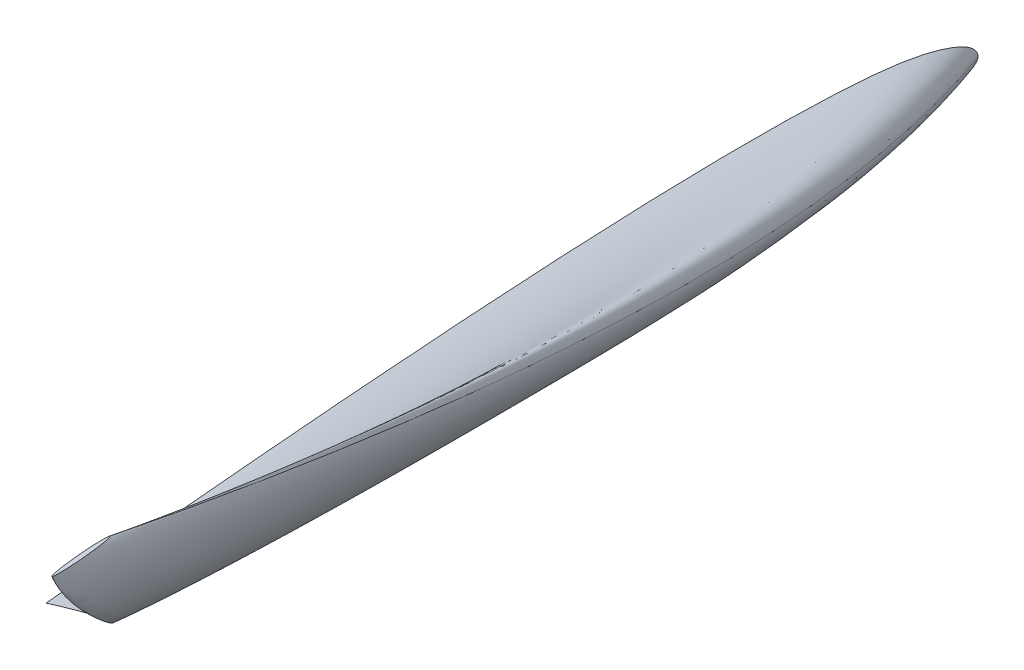
ISO-10303-21;
HEADER;
FILE_DESCRIPTION(('STEP AP214'),'2;1');
FILE_NAME('part.step','',(''),(''),'','','');
FILE_SCHEMA(('AUTOMOTIVE_DESIGN { 1 0 10303 214 1 1 1 1 }'));
ENDSEC;
DATA;
#1=APPLICATION_CONTEXT('core data for automotive mechanical design processes');
#2=APPLICATION_PROTOCOL_DEFINITION('international standard','automotive_design',2000,#1);
#3=PRODUCT_CONTEXT('',#1,'mechanical');
#4=PRODUCT('Part','Part','',(#3));
#5=PRODUCT_RELATED_PRODUCT_CATEGORY('part','',(#4));
#6=PRODUCT_DEFINITION_FORMATION('','',#4);
#7=PRODUCT_DEFINITION_CONTEXT('part definition',#1,'design');
#8=PRODUCT_DEFINITION('design','',#6,#7);
#9=PRODUCT_DEFINITION_SHAPE('','',#8);
#10=(LENGTH_UNIT() NAMED_UNIT(*) SI_UNIT(.MILLI.,.METRE.));
#11=(NAMED_UNIT(*) PLANE_ANGLE_UNIT() SI_UNIT($,.RADIAN.));
#12=(NAMED_UNIT(*) SI_UNIT($,.STERADIAN.) SOLID_ANGLE_UNIT());
#13=UNCERTAINTY_MEASURE_WITH_UNIT(LENGTH_MEASURE(1.E-05),#10,'distance_accuracy_value','');
#14=(GEOMETRIC_REPRESENTATION_CONTEXT(3) GLOBAL_UNCERTAINTY_ASSIGNED_CONTEXT((#13)) GLOBAL_UNIT_ASSIGNED_CONTEXT((#10,
#11,#12)) REPRESENTATION_CONTEXT('',''));
#15=CARTESIAN_POINT('',(0.,0.,0.));
#16=DIRECTION('',(0.,0.,1.));
#17=DIRECTION('',(1.,0.,0.));
#18=AXIS2_PLACEMENT_3D('',#15,#16,#17);
#19=CARTESIAN_POINT('',(3360.,218.360771483085,401.404372852106));
#20=DIRECTION('',(1.,0.,0.));
#21=DIRECTION('',(0.,0.,-1.));
#22=AXIS2_PLACEMENT_3D('',#19,#20,#21);
#23=PLANE('',#22);
#24=CARTESIAN_POINT('',(3360.,229.119465308292,843.640653398132));
#25=CARTESIAN_POINT('',(3360.,215.464436299408,713.782358784149));
#26=CARTESIAN_POINT('',(3360.,216.556538162591,406.942823213811));
#27=CARTESIAN_POINT('',(3360.,221.464120714238,350.841141044395));
#28=CARTESIAN_POINT('',(3360.,225.556401664433,317.114757853201));
#29=CARTESIAN_POINT('',(3360.,233.068162146631,316.471394972551));
#30=B_SPLINE_CURVE_WITH_KNOTS('',3,(#24,#25,#26,#27,#28,#29),.UNSPECIFIED.,.F.,.F.,(4,1,1,4),
(0.,0.526727838627796,0.626727838627796,1.),.UNSPECIFIED.);
#31=CARTESIAN_POINT('',(3360.,229.119465308292,843.640653398131));
#32=VERTEX_POINT('',#31);
#33=CARTESIAN_POINT('',(3360.,233.06816214663,316.471394972551));
#34=VERTEX_POINT('',#33);
#35=EDGE_CURVE('E50',#32,#34,#30,.T.);
#36=ORIENTED_EDGE('',*,*,#35,.F.);
#37=CARTESIAN_POINT('',(3360.,233.06816214663,316.471394972551));
#38=CARTESIAN_POINT('',(3360.,239.351434862468,316.465549593679));
#39=CARTESIAN_POINT('',(3360.,249.881065643531,339.710619295084));
#40=CARTESIAN_POINT('',(3360.,267.643801952184,486.64347624095));
#41=CARTESIAN_POINT('',(3360.,233.367819513329,792.168022962579));
#42=CARTESIAN_POINT('',(3360.,229.119465308292,843.640653398131));
#43=B_SPLINE_CURVE_WITH_KNOTS('',3,(#37,#38,#39,#40,#41,#42),.UNSPECIFIED.,.F.,.F.,(4,1,1,4),
(0.,0.0940570235538322,0.194057023553832,1.),.UNSPECIFIED.);
#44=EDGE_CURVE('E11',#34,#32,#43,.T.);
#45=ORIENTED_EDGE('',*,*,#44,.F.);
#46=EDGE_LOOP('',(#36,#45));
#47=FACE_BOUND('',#46,.T.);
#48=ADVANCED_FACE('F40',(#47),#23,.F.);
#49=CARTESIAN_POINT('',(3477.86129527714,360.,941.693828195113));
#50=DIRECTION('',(0.,1.,0.));
#51=DIRECTION('',(0.,0.,1.));
#52=AXIS2_PLACEMENT_3D('',#49,#50,#51);
#53=PLANE('',#52);
#54=CARTESIAN_POINT('',(3477.86129527714,360.,941.693828195113));
#55=DIRECTION('',(0.,1.,0.));
#56=DIRECTION('',(-0.0905357460425174,0.,-0.995893206467704));
#57=AXIS2_PLACEMENT_3D('',#54,#55,#56);
#58=ELLIPSE('',#57,18.1729529725233,1.3406276783011);
#59=CARTESIAN_POINT('',(3476.22498409216,360.,923.595100798655));
#60=VERTEX_POINT('',#59);
#61=CARTESIAN_POINT('',(3479.5065971323,360.,959.792148601906));
#62=VERTEX_POINT('',#61);
#63=EDGE_CURVE('E78',#60,#62,#58,.T.);
#64=ORIENTED_EDGE('',*,*,#63,.T.);
#65=EDGE_CURVE('E74',#62,#60,#58,.T.);
#66=ORIENTED_EDGE('',*,*,#65,.T.);
#67=EDGE_LOOP('',(#64,#66));
#68=FACE_BOUND('',#67,.T.);
#69=ADVANCED_FACE('F88',(#68),#53,.T.);
#70=CARTESIAN_POINT('',(3476.22498409216,360.,923.595100798655));
#71=CARTESIAN_POINT('',(3477.50289840618,325.745592423653,745.570228461219));
#72=CARTESIAN_POINT('',(3456.56167243609,277.724137591087,503.109039222426));
#73=CARTESIAN_POINT('',(3360.,233.068162146631,316.471394972551));
#74=CARTESIAN_POINT('',(3476.24886622401,360.,923.595100798655));
#75=CARTESIAN_POINT('',(3477.51881982741,325.630831702288,745.58005742055));
#76=CARTESIAN_POINT('',(3456.5696331467,277.494616148357,503.128697141088));
#77=CARTESIAN_POINT('',(3360.,232.723879982536,316.500881850544));
#78=CARTESIAN_POINT('',(3476.28245943853,360.,923.607471111499));
#79=CARTESIAN_POINT('',(3477.54121530375,325.461370510209,745.631235726874));
#80=CARTESIAN_POINT('',(3456.58083088488,277.155693764199,503.218683440893));
#81=CARTESIAN_POINT('',(3360.,232.215496406299,316.629676143829));
#82=CARTESIAN_POINT('',(3476.32172938726,360.,923.637056443417));
#83=CARTESIAN_POINT('',(3477.56739526958,325.255026312158,745.754373604101));
#84=CARTESIAN_POINT('',(3456.59392086779,276.743005368097,503.435373863428));
#85=CARTESIAN_POINT('',(3360.,231.596463812146,316.939919111673));
#86=CARTESIAN_POINT('',(3476.35696498753,360.,923.671486481567));
#87=CARTESIAN_POINT('',(3477.59088566975,325.062572123676,745.904703524997));
#88=CARTESIAN_POINT('',(3456.60566606787,276.358096991132,503.701603667071));
#89=CARTESIAN_POINT('',(3359.99999999999,231.019101246698,317.322048798062));
#90=CARTESIAN_POINT('',(3476.38561854638,360.,923.707359056952));
#91=CARTESIAN_POINT('',(3477.60998804232,324.891551965099,746.084284897938));
#92=CARTESIAN_POINT('',(3456.61521725416,276.016056673978,504.024893837568));
#93=CARTESIAN_POINT('',(3360.00000000001,230.506040770966,317.789047766114));
#94=CARTESIAN_POINT('',(3476.41281917664,360.,923.746810279595));
#95=CARTESIAN_POINT('',(3477.62812179583,324.738331616615,746.282603446434));
#96=CARTESIAN_POINT('',(3456.62428413091,275.709615977011,504.382079711915));
#97=CARTESIAN_POINT('',(3360.,230.046379725516,318.305100966314));
#98=CARTESIAN_POINT('',(3476.43876968108,360.,923.787676433258));
#99=CARTESIAN_POINT('',(3477.64542213212,324.595632471751,746.490888976788));
#100=CARTESIAN_POINT('',(3456.63293429906,275.424217687283,504.757784618961));
#101=CARTESIAN_POINT('',(3360.,229.618282290924,318.848225250052));
#102=CARTESIAN_POINT('',(3476.46833600048,360.,923.839591807587));
#103=CARTESIAN_POINT('',(3477.66513301172,324.434586722201,746.764485221057));
#104=CARTESIAN_POINT('',(3456.64278973886,275.102126188183,505.253061733171));
#105=CARTESIAN_POINT('',(3359.99999999999,229.135145042275,319.565183234203));
#106=CARTESIAN_POINT('',(3476.50056942084,360.,923.903209634812));
#107=CARTESIAN_POINT('',(3477.68662195863,324.26296094321,747.107025317983));
#108=CARTESIAN_POINT('',(3456.65353421232,274.7588746302,505.874524099796));
#109=CARTESIAN_POINT('',(3360.00000000001,228.620267705301,320.465567870528));
#110=CARTESIAN_POINT('',(3476.53090541316,360.,923.968133926498));
#111=CARTESIAN_POINT('',(3477.70684595351,324.108461827831,747.459488895288));
#112=CARTESIAN_POINT('',(3456.66364620976,274.449876399442,506.51452696272));
#113=CARTESIAN_POINT('',(3360.,228.156770359163,321.39311001907));
#114=CARTESIAN_POINT('',(3476.56911661232,360.,924.055902961116));
#115=CARTESIAN_POINT('',(3477.73232008629,323.921090854389,747.939031516089));
#116=CARTESIAN_POINT('',(3456.67638327615,274.075134452558,507.385843169704));
#117=CARTESIAN_POINT('',(3360.00000000001,227.594657438836,322.656199812237));
#118=CARTESIAN_POINT('',(3476.61323621654,360.,924.166860514622));
#119=CARTESIAN_POINT('',(3477.76173315576,323.715309869132,748.551163346939));
#120=CARTESIAN_POINT('',(3456.69108981087,273.663572482045,508.499149277898));
#121=CARTESIAN_POINT('',(3359.99999999999,226.977314483068,324.270680197775));
#122=CARTESIAN_POINT('',(3476.66180896964,359.999999999999,924.301573857155));
#123=CARTESIAN_POINT('',(3477.79411499116,323.500918066972,749.298116636095));
#124=CARTESIAN_POINT('',(3456.70728072859,273.234788877725,509.858342513678));
#125=CARTESIAN_POINT('',(3360.00000000001,226.334139076587,326.242113380179));
#126=CARTESIAN_POINT('',(3476.70747121039,360.,924.437421739965));
#127=CARTESIAN_POINT('',(3477.82455648499,323.31116949993,750.053305521789));
#128=CARTESIAN_POINT('',(3456.72250147549,272.85529174364,511.232872402255));
#129=CARTESIAN_POINT('',(3359.99999999999,225.76489337546,328.23598427164));
#130=CARTESIAN_POINT('',(3476.75062671054,360.,924.574122835843));
#131=CARTESIAN_POINT('',(3477.85332681843,323.140744176191,750.814237852598));
#132=CARTESIAN_POINT('',(3456.73688664222,272.514441096163,512.618035967995));
#133=CARTESIAN_POINT('',(3360.00000000001,225.253617404244,330.245379072309));
#134=CARTESIAN_POINT('',(3476.79167924184,360.,924.711395817581));
#135=CARTESIAN_POINT('',(3477.88069517263,322.985943194086,751.57931767262));
#136=CARTESIAN_POINT('',(3456.75057081931,272.204839131952,514.010922626302));
#137=CARTESIAN_POINT('',(3359.99999999999,224.789214457928,332.266072568902));
#138=CARTESIAN_POINT('',(3476.83096941497,360.,924.849170782096));
#139=CARTESIAN_POINT('',(3477.90688862138,322.844051511084,752.347555717361));
#140=CARTESIAN_POINT('',(3456.7636675437,271.921055765949,515.409623751269));
#141=CARTESIAN_POINT('',(3360.00000000001,224.363539408923,334.295236774094));
#142=CARTESIAN_POINT('',(3476.8688378406,360.,924.987377826309));
#143=CARTESIAN_POINT('',(3477.93213423847,322.713022453105,753.118264012953));
#144=CARTESIAN_POINT('',(3456.77629035223,271.65899764999,516.812833298239));
#145=CARTESIAN_POINT('',(3360.,223.970452234985,336.330947572444));
#146=CARTESIAN_POINT('',(3476.90541996829,360.000000000001,925.125939513385));
#147=CARTESIAN_POINT('',(3477.9565223236,322.591270830441,753.890927724912));
#148=CARTESIAN_POINT('',(3456.7884843948,271.415494404662,518.219599035081));
#149=CARTESIAN_POINT('',(3360.00000000001,223.605197366992,338.371815334168));
#150=CARTESIAN_POINT('',(3476.94085124757,360.,925.264778406488));
#151=CARTESIAN_POINT('',(3477.98014317644,322.477518184523,754.665156879071));
#152=CARTESIAN_POINT('',(3456.80029482122,271.187989112826,519.629218450297));
#153=CARTESIAN_POINT('',(3359.99999999999,223.263939429239,340.416825010441));
#154=CARTESIAN_POINT('',(3476.97526254345,360.,925.40386964282));
#155=CARTESIAN_POINT('',(3478.00308404037,322.370760891292,755.440681586747));
#156=CARTESIAN_POINT('',(3456.81176525319,270.974474526366,521.041176629316));
#157=CARTESIAN_POINT('',(3360.,222.943667549549,342.465216660804));
#158=CARTESIAN_POINT('',(3477.00878472095,360.,925.54318835958));
#159=CARTESIAN_POINT('',(3478.0254321587,322.270102369189,756.217282334513));
#160=CARTESIAN_POINT('',(3456.82293931235,270.773157482158,522.455059408089));
#161=CARTESIAN_POINT('',(3360.,222.641691983238,344.516381470583));
#162=CARTESIAN_POINT('',(3477.05238566926,360.,925.729210385944));
#163=CARTESIAN_POINT('',(3478.05449945757,322.143169486578,757.253965806382));
#164=CARTESIAN_POINT('',(3456.83747296178,270.519291716937,524.342404325464));
#165=CARTESIAN_POINT('',(3359.99999999999,222.260893335405,347.254387833462));
#166=CARTESIAN_POINT('',(3477.10500231925,359.999999999999,925.962158232891));
#167=CARTESIAN_POINT('',(3478.08957722424,321.996372041088,758.551704248727));
#168=CARTESIAN_POINT('',(3456.85501184512,270.225696825957,526.704933363207));
#169=CARTESIAN_POINT('',(3360.00000000001,221.820500998936,350.681707466604));
#170=CARTESIAN_POINT('',(3477.16562772992,360.,926.242263212819));
#171=CARTESIAN_POINT('',(3478.12999416468,321.83553111333,760.11123540292));
#172=CARTESIAN_POINT('',(3456.87522031534,269.90401497044,529.543890691665));
#173=CARTESIAN_POINT('',(3360.,221.337978215659,354.800090969327));
#174=CARTESIAN_POINT('',(3477.22406616612,360.,926.522826114185));
#175=CARTESIAN_POINT('',(3478.16895312214,321.686405360236,761.672390989533));
#176=CARTESIAN_POINT('',(3456.89469979407,269.605763464253,532.385638963523));
#177=CARTESIAN_POINT('',(3360.,220.890600956379,358.922431926432));
#178=CARTESIAN_POINT('',(3477.28059016265,360.,926.803783235637));
#179=CARTESIAN_POINT('',(3478.2066357865,321.547092248125,763.234832584653));
#180=CARTESIAN_POINT('',(3456.91354112625,269.327137240032,535.229565032311));
#181=CARTESIAN_POINT('',(3360.,220.472661620047,363.047842468886));
#182=CARTESIAN_POINT('',(3477.33542261918,360.,927.085073817901));
#183=CARTESIAN_POINT('',(3478.24319075752,321.413343422107,764.798043645473));
#184=CARTESIAN_POINT('',(3456.93181861176,269.059639587995,538.074696571687));
#185=CARTESIAN_POINT('',(3360.,220.071415141993,367.174894486819));
#186=CARTESIAN_POINT('',(3477.38872308111,360.,927.366659028487));
#187=CARTESIAN_POINT('',(3478.2787243988,321.288772360512,766.362336067908));
#188=CARTESIAN_POINT('',(3456.9495854324,268.810497464805,540.921696205971));
#189=CARTESIAN_POINT('',(3360.,219.697701957207,371.304601332952));
#190=CARTESIAN_POINT('',(3477.44065109385,360.,927.648500034908));
#191=CARTESIAN_POINT('',(3478.31334307397,321.186725103808,767.928683931964));
#192=CARTESIAN_POINT('',(3456.96689476999,268.606402951397,543.772550927663));
#193=CARTESIAN_POINT('',(3360.,219.391560187095,375.439962912279));
#194=CARTESIAN_POINT('',(3477.49131584607,360.,927.930571139987));
#195=CARTESIAN_POINT('',(3478.34711957544,321.104042781617,769.496445150946));
#196=CARTESIAN_POINT('',(3456.98378302072,268.441038307015,546.626002260548));
#197=CARTESIAN_POINT('',(3360.,219.143513220523,379.579104359067));
#198=CARTESIAN_POINT('',(3477.54082652639,360.,928.212846646545));
#199=CARTESIAN_POINT('',(3478.38012669566,321.03670965,771.065178570125));
#200=CARTESIAN_POINT('',(3457.00028658084,268.306372043781,549.481193592348));
#201=CARTESIAN_POINT('',(3360.00000000001,218.941513825671,383.720753603489));
#202=CARTESIAN_POINT('',(3477.58926424187,360.,928.495308389489));
#203=CARTESIAN_POINT('',(3478.41241850598,320.980239548264,772.634507344847));
#204=CARTESIAN_POINT('',(3457.01643248599,268.193431840307,552.337389398848));
#205=CARTESIAN_POINT('',(3360.,218.772103520461,387.863816441767));
#206=CARTESIAN_POINT('',(3477.63671009953,360.,928.777938203724));
#207=CARTESIAN_POINT('',(3478.44404907776,320.932018966431,774.20426237455));
#208=CARTESIAN_POINT('',(3457.03224777188,268.096990676643,555.194269644019));
#209=CARTESIAN_POINT('',(3360.,218.627441774965,392.007821902406));
#210=CARTESIAN_POINT('',(3477.68322494701,360.,929.060722839185));
#211=CARTESIAN_POINT('',(3478.47505897607,320.889744038935,775.774310256639));
#212=CARTESIAN_POINT('',(3457.04775272104,268.012440821651,558.051580772736));
#213=CARTESIAN_POINT('',(3360.,218.500616992476,396.15239627775));
#214=CARTESIAN_POINT('',(3477.72886963192,360.,929.343649045809));
#215=CARTESIAN_POINT('',(3478.50548876602,320.851991598408,777.344584260013));
#216=CARTESIAN_POINT('',(3457.06296761601,267.936935940597,560.90920257286));
#217=CARTESIAN_POINT('',(3360.,218.387359670896,400.297365874625));
#218=CARTESIAN_POINT('',(3477.77369177675,360.,929.626706793688));
#219=CARTESIAN_POINT('',(3478.5353701959,320.817875157555,778.915039201991));
#220=CARTESIAN_POINT('',(3457.07790833095,267.868703058891,563.767054708937));
#221=CARTESIAN_POINT('',(3360.,218.285010348337,404.442615204802));
#222=CARTESIAN_POINT('',(3477.81773900398,360.,929.909886052913));
#223=CARTESIAN_POINT('',(3478.56473501406,320.786786470774,780.485646691068));
#224=CARTESIAN_POINT('',(3457.09259074003,267.806525685328,566.625090427866));
#225=CARTESIAN_POINT('',(3360.,218.191744287992,408.588079153582));
#226=CARTESIAN_POINT('',(3477.87548583366,360.,930.287610025861));
#227=CARTESIAN_POINT('',(3478.60323290051,320.7488173797,782.579965848696));
#228=CARTESIAN_POINT('',(3457.11183968326,267.730587503181,570.436004770174));
#229=CARTESIAN_POINT('',(3360.,218.077837014771,414.115588680569));
#230=CARTESIAN_POINT('',(3477.94592113986,360.,930.760029816109));
#231=CARTESIAN_POINT('',(3478.65018977131,320.707032777814,785.198152921393));
#232=CARTESIAN_POINT('',(3457.13531811866,267.647018299409,575.199959125319));
#233=CARTESIAN_POINT('',(3360.,217.952483209114,421.025310318162));
#234=CARTESIAN_POINT('',(3478.02788986456,360.,931.327308221381));
#235=CARTESIAN_POINT('',(3478.70483558778,320.664235240098,788.340349543142));
#236=CARTESIAN_POINT('',(3457.16264102689,267.561423223977,580.917073963547));
#237=CARTESIAN_POINT('',(3360.,217.824090595965,429.317343372869));
#238=CARTESIAN_POINT('',(3478.10750847994,360.,931.894920941163));
#239=CARTESIAN_POINT('',(3478.75791466469,320.627687367235,791.482858349118));
#240=CARTESIAN_POINT('',(3457.18918056535,267.488327478251,586.634478855716));
#241=CARTESIAN_POINT('',(3360.,217.714446977376,437.609644351231));
#242=CARTESIAN_POINT('',(3478.18493904529,360.,932.462836308465));
#243=CARTESIAN_POINT('',(3478.80953504159,320.596627867633,794.625635661218));
#244=CARTESIAN_POINT('',(3457.21499075379,267.426208479047,592.352118112614));
#245=CARTESIAN_POINT('',(3360.,217.621268478571,445.902145552927));
#246=CARTESIAN_POINT('',(3478.26032915353,360.,933.031025751844));
#247=CARTESIAN_POINT('',(3478.85979511376,320.570518846227,797.768646713676));
#248=CARTESIAN_POINT('',(3457.24012078988,267.373990436235,598.06995077415));
#249=CARTESIAN_POINT('',(3360.,217.542941414353,454.194799823542));
#250=CARTESIAN_POINT('',(3478.33378810911,360.,933.599468302294));
#251=CARTESIAN_POINT('',(3478.90876775081,320.548960477945,800.911865577985));
#252=CARTESIAN_POINT('',(3457.26460710841,267.33087369967,603.78794595232));
#253=CARTESIAN_POINT('',(3360.,217.478266309505,462.487571315572));
#254=CARTESIAN_POINT('',(3478.40542521646,360.,934.168142990803));
#255=CARTESIAN_POINT('',(3478.95652582238,320.531653690159,804.055269000599));
#256=CARTESIAN_POINT('',(3457.28848614419,267.296260124099,609.506078109037));
#257=CARTESIAN_POINT('',(3360.,217.426345946149,470.780432206393));
#258=CARTESIAN_POINT('',(3478.47531997989,360.,934.73703456634));
#259=CARTESIAN_POINT('',(3479.00312233133,320.518369194888,807.19883919144));
#260=CARTESIAN_POINT('',(3457.31178439866,267.269691133556,615.224326915182));
#261=CARTESIAN_POINT('',(3360.,217.386492460334,479.073359627842));
#262=CARTESIAN_POINT('',(3478.54355190371,360.,935.306127777872));
#263=CARTESIAN_POINT('',(3479.04861028054,320.508931351626,810.342559565881));
#264=CARTESIAN_POINT('',(3457.33452837328,267.250815447033,620.942674452533));
#265=CARTESIAN_POINT('',(3360.,217.358178930549,487.366334328103));
#266=CARTESIAN_POINT('',(3478.61017922655,360.,935.875411170588));
#267=CARTESIAN_POINT('',(3479.09302849577,320.503204890443,813.486416865848));
#268=CARTESIAN_POINT('',(3457.35673748088,267.239362524666,626.66110565975));
#269=CARTESIAN_POINT('',(3360.,217.340999547,495.65933944257));
#270=CARTESIAN_POINT('',(3478.67526018703,360.,936.44487328968));
#271=CARTESIAN_POINT('',(3479.13641580275,320.501086883847,816.630398408706));
#272=CARTESIAN_POINT('',(3457.37843113438,267.235126511474,632.379606626374));
#273=CARTESIAN_POINT('',(3360.,217.334645527212,503.952359832961));
#274=CARTESIAN_POINT('',(3478.73883868973,360.,937.014505156564));
#275=CARTESIAN_POINT('',(3479.17880147122,320.502500338751,819.774493545332));
#276=CARTESIAN_POINT('',(3457.39962396861,267.237953421283,638.098165032742));
#277=CARTESIAN_POINT('',(3360.,217.338885891924,512.245381509069));
#278=CARTESIAN_POINT('',(3478.80095863925,360.,937.584297792658));
#279=CARTESIAN_POINT('',(3479.2202147709,320.50738982728,822.918691884484));
#280=CARTESIAN_POINT('',(3457.42033061845,267.24773239834,643.816769074953));
#281=CARTESIAN_POINT('',(3360.,217.35355435751,520.53839125434));
#282=CARTESIAN_POINT('',(3478.86164880356,360.,938.154244557695));
#283=CARTESIAN_POINT('',(3479.26067488044,320.515718202062,826.062984745904));
#284=CARTESIAN_POINT('',(3457.44056067322,267.264389147905,649.535408032755));
#285=CARTESIAN_POINT('',(3360.,217.378539481858,528.831376308524));
#286=CARTESIAN_POINT('',(3478.92093795065,360.,938.724338811409));
#287=CARTESIAN_POINT('',(3479.3002009785,320.527463966051,829.207363520009));
#288=CARTESIAN_POINT('',(3457.46032372225,267.287880675883,655.254071327251));
#289=CARTESIAN_POINT('',(3360.,217.413776773825,537.124324123411));
#290=CARTESIAN_POINT('',(3478.97884972242,360.,939.294574646104));
#291=CARTESIAN_POINT('',(3479.33880882635,320.542619789877,832.351820089803));
#292=CARTESIAN_POINT('',(3457.47962764618,267.318192323534,660.972748632145));
#293=CARTESIAN_POINT('',(3360.,217.459244245301,545.417222163405));
#294=CARTESIAN_POINT('',(3479.03540776077,360.,939.864946154081));
#295=CARTESIAN_POINT('',(3479.37651418525,320.561190407517,835.496346277627));
#296=CARTESIAN_POINT('',(3457.49848032562,267.355333558816,666.691429499816));
#297=CARTESIAN_POINT('',(3360.,217.514956098223,553.710057710923));
#298=CARTESIAN_POINT('',(3479.09061977696,360.,940.435449500914));
#299=CARTESIAN_POINT('',(3479.41332219604,320.583192970431,838.640935184524));
#300=CARTESIAN_POINT('',(3457.51688433103,267.399338684644,672.410103966776));
#301=CARTESIAN_POINT('',(3360.00000000001,217.580963786965,562.002817737946));
#302=CARTESIAN_POINT('',(3479.14449348224,360.,941.006080852174));
#303=CARTESIAN_POINT('',(3479.44923799956,320.60865374004,841.785579737612));
#304=CARTESIAN_POINT('',(3457.53484223278,267.45026022386,678.128761721693));
#305=CARTESIAN_POINT('',(3360.,217.657346095791,570.295488694692));
#306=CARTESIAN_POINT('',(3479.21455095643,360.,941.767088213853));
#307=CARTESIAN_POINT('',(3479.49594298235,320.647265148011,845.978503645822));
#308=CARTESIAN_POINT('',(3457.55819472418,267.527483039802,685.753602176434));
#309=CARTESIAN_POINT('',(3360.,217.773180319703,581.352245695964));
#310=CARTESIAN_POINT('',(3479.29881557817,360.,942.718648254881));
#311=CARTESIAN_POINT('',(3479.55211939684,320.704385007173,851.219760687856));
#312=CARTESIAN_POINT('',(3457.58628293142,267.641722758127,695.284556219474));
#313=CARTESIAN_POINT('',(3359.99999999999,217.944539897191,595.172896740009));
#314=CARTESIAN_POINT('',(3479.39457668843,360.,943.860981744276));
#315=CARTESIAN_POINT('',(3479.61596013702,320.787593356985,857.509376080362));
#316=CARTESIAN_POINT('',(3457.61820330152,267.808139457751,706.721453515092));
#317=CARTESIAN_POINT('',(3360.00000000001,218.194164946626,611.757075938739));
#318=CARTESIAN_POINT('',(3479.48491648062,360.,945.003756771707));
#319=CARTESIAN_POINT('',(3479.67618666514,320.886128417684,863.799034181626));
#320=CARTESIAN_POINT('',(3457.64831656557,268.005209579148,718.157994690187));
#321=CARTESIAN_POINT('',(3359.99999999999,218.489770128721,628.340500187666));
#322=CARTESIAN_POINT('',(3479.56962495222,360.,946.146962822524));
#323=CARTESIAN_POINT('',(3479.73265897955,321.000816525175,870.088669334995));
#324=CARTESIAN_POINT('',(3457.67655272278,268.23458579413,729.594058946109));
#325=CARTESIAN_POINT('',(3360.,218.833834451195,644.92299354614));
#326=CARTESIAN_POINT('',(3479.64849210072,360.,947.290589382074));
#327=CARTESIAN_POINT('',(3479.78523707855,321.132688980473,876.37820134169));
#328=CARTESIAN_POINT('',(3457.70284177227,268.498330704726,741.029496399949));
#329=CARTESIAN_POINT('',(3360.,219.229451817089,661.504336447125));
#330=CARTESIAN_POINT('',(3479.72111678249,360.,948.434627718638));
#331=CARTESIAN_POINT('',(3479.83365353306,321.282975048805,882.6675410653));
#332=CARTESIAN_POINT('',(3457.72704999953,268.798902841391,752.464137510605));
#333=CARTESIAN_POINT('',(3360.,219.680310022087,678.084278944828));
#334=CARTESIAN_POINT('',(3479.78709785388,360.,949.579069100493));
#335=CARTESIAN_POINT('',(3479.87764091399,321.453214725356,888.956568575284));
#336=CARTESIAN_POINT('',(3457.74904369,269.139382194493,763.897751148719));
#337=CARTESIAN_POINT('',(3360.,220.191029051739,694.662478711071));
#338=CARTESIAN_POINT('',(3479.84567318285,360.,950.72391321244));
#339=CARTESIAN_POINT('',(3479.9166911333,321.645189189926,895.245161070914));
#340=CARTESIAN_POINT('',(3457.76856879965,269.523331123632,775.330092028031));
#341=CARTESIAN_POINT('',(3359.99999999999,220.766952445448,711.238567974065));
#342=CARTESIAN_POINT('',(3479.89608063737,360.,951.869159739279));
#343=CARTESIAN_POINT('',(3479.95029610298,321.861238363866,901.533123845485));
#344=CARTESIAN_POINT('',(3457.78537128449,269.955429471513,786.760771050333));
#345=CARTESIAN_POINT('',(3360.,221.415099967269,727.8119632441));
#346=CARTESIAN_POINT('',(3479.93695527374,360.,953.014756117092));
#347=CARTESIAN_POINT('',(3479.97754586056,322.103996801493,907.820230692183));
#348=CARTESIAN_POINT('',(3457.79899616328,270.440946346766,798.189388365918));
#349=CARTESIAN_POINT('',(3360.,222.143375280149,744.38209102857));
#350=CARTESIAN_POINT('',(3479.96663484376,360.,954.160769940915));
#351=CARTESIAN_POINT('',(3479.99733224057,322.376991430895,914.10620001982));
#352=CARTESIAN_POINT('',(3457.80888935329,270.986935605571,809.615313197368));
#353=CARTESIAN_POINT('',(3360.,222.962359168357,760.947971363834));
#354=CARTESIAN_POINT('',(3479.98217605953,360.,955.306948189439));
#355=CARTESIAN_POINT('',(3480.00769305109,322.684962900438,920.390425822701));
#356=CARTESIAN_POINT('',(3457.81406975855,271.602878544656,821.037586554605));
#357=CARTESIAN_POINT('',(3360.,223.886273576983,777.508292275427));
#358=CARTESIAN_POINT('',(3479.97936895709,360.,956.453482345838));
#359=CARTESIAN_POINT('',(3480.00582164946,323.032651858482,926.672598431452));
#360=CARTESIAN_POINT('',(3457.81313405773,272.298256460744,832.455397615709));
#361=CARTESIAN_POINT('',(3360.,224.929340451116,794.061741788883));
#362=CARTESIAN_POINT('',(3479.94910320336,360.000000000001,957.599226232361));
#363=CARTESIAN_POINT('',(3479.98564448031,323.429226643265,932.950898923942));
#364=CARTESIAN_POINT('',(3457.80304547316,273.091406030309,843.866254714165));
#365=CARTESIAN_POINT('',(3360.,226.119064805464,810.605155493306));
#366=CARTESIAN_POINT('',(3479.88620846922,359.999999999999,958.553335186671));
#367=CARTESIAN_POINT('',(3479.94371465754,323.808084101394,938.178697528063));
#368=CARTESIAN_POINT('',(3457.78208056177,273.849120946569,853.367742968099));
#369=CARTESIAN_POINT('',(3360.,227.255637179854,824.380333397052));
#370=CARTESIAN_POINT('',(3479.7916938934,360.000000000001,959.215270604988));
#371=CARTESIAN_POINT('',(3479.88070494033,324.105896515117,941.831303089846));
#372=CARTESIAN_POINT('',(3457.75057570317,274.444745774013,860.011018673347));
#373=CARTESIAN_POINT('',(3360.,228.149074421019,834.014279245766));
#374=CARTESIAN_POINT('',(3479.70501437757,360.,959.540242191311));
#375=CARTESIAN_POINT('',(3479.82291859645,324.264238658052,943.652689898268));
#376=CARTESIAN_POINT('',(3457.72168253123,274.761430059885,863.328820703869));
#377=CARTESIAN_POINT('',(3360.,228.624100849827,838.828496498387));
#378=CARTESIAN_POINT('',(3479.62704135595,360.000000000001,959.712754258753));
#379=CARTESIAN_POINT('',(3479.77093658204,324.357599134011,944.684401355908));
#380=CARTESIAN_POINT('',(3457.69569152402,274.948151011803,865.219731551707));
#381=CARTESIAN_POINT('',(3360.,228.904182277704,841.578606736422));
#382=CARTESIAN_POINT('',(3479.55416523803,360.,959.787824228659));
#383=CARTESIAN_POINT('',(3479.72235250342,324.405269667413,945.19269827481));
#384=CARTESIAN_POINT('',(3457.67139948471,275.043492078607,866.161255419604));
#385=CARTESIAN_POINT('',(3360.,229.047193877911,842.953357553316));
#386=CARTESIAN_POINT('',(3479.5065971323,360.,959.792148601906));
#387=CARTESIAN_POINT('',(3479.69064043294,324.429360144207,945.424679805247));
#388=CARTESIAN_POINT('',(3457.65554344947,275.091673032195,866.620894107231));
#389=CARTESIAN_POINT('',(3360.,229.119465308292,843.640653398132));
#390=B_SPLINE_SURFACE_WITH_KNOTS('',3,3,((#70,#71,#72,#73),(#74,#75,#76,#77),(#78,#79,#80,#81),
(#82,#83,#84,#85),(#86,#87,#88,#89),(#90,#91,#92,#93),(#94,#95,#96,#97),(#98,#99,#100,#101),
(#102,#103,#104,#105),(#106,#107,#108,#109),(#110,#111,#112,#113),(#114,#115,#116,#117),(#118,
#119,#120,#121),(#122,#123,#124,#125),(#126,#127,#128,#129),(#130,#131,#132,#133),(#134,#135,
#136,#137),(#138,#139,#140,#141),(#142,#143,#144,#145),(#146,#147,#148,#149),(#150,#151,#152,
#153),(#154,#155,#156,#157),(#158,#159,#160,#161),(#162,#163,#164,#165),(#166,#167,#168,#169),
(#170,#171,#172,#173),(#174,#175,#176,#177),(#178,#179,#180,#181),(#182,#183,#184,#185),(#186,
#187,#188,#189),(#190,#191,#192,#193),(#194,#195,#196,#197),(#198,#199,#200,#201),(#202,#203,
#204,#205),(#206,#207,#208,#209),(#210,#211,#212,#213),(#214,#215,#216,#217),(#218,#219,#220,
#221),(#222,#223,#224,#225),(#226,#227,#228,#229),(#230,#231,#232,#233),(#234,#235,#236,#237),
(#238,#239,#240,#241),(#242,#243,#244,#245),(#246,#247,#248,#249),(#250,#251,#252,#253),(#254,
#255,#256,#257),(#258,#259,#260,#261),(#262,#263,#264,#265),(#266,#267,#268,#269),(#270,#271,
#272,#273),(#274,#275,#276,#277),(#278,#279,#280,#281),(#282,#283,#284,#285),(#286,#287,#288,
#289),(#290,#291,#292,#293),(#294,#295,#296,#297),(#298,#299,#300,#301),(#302,#303,#304,#305),
(#306,#307,#308,#309),(#310,#311,#312,#313),(#314,#315,#316,#317),(#318,#319,#320,#321),(#322,
#323,#324,#325),(#326,#327,#328,#329),(#330,#331,#332,#333),(#334,#335,#336,#337),(#338,#339,
#340,#341),(#342,#343,#344,#345),(#346,#347,#348,#349),(#350,#351,#352,#353),(#354,#355,#356,
#357),(#358,#359,#360,#361),(#362,#363,#364,#365),(#366,#367,#368,#369),(#370,#371,#372,#373),
(#374,#375,#376,#377),(#378,#379,#380,#381),(#382,#383,#384,#385),(#386,#387,#388,#389)),
.UNSPECIFIED.,.F.,.F.,.F.,(4,1,1,1,1,1,1,1,1,1,1,1,1,1,1,1,1,1,1,1,1,1,1,1,1,1,1,1,1,1,1,1,1,1,
1,1,1,1,1,1,1,1,1,1,1,1,1,1,1,1,1,1,1,1,1,1,1,1,1,1,1,1,1,1,1,1,1,1,1,1,1,1,1,1,1,1,1,4),(4,4),
(0.500930309619149,0.501905055108174,0.502392427852687,0.502879800597199,0.503854546086224,
0.504341918830737,0.504829291575249,0.505804037064274,0.506778782553299,0.507753528042325,
0.50872827353135,0.5106777645094,0.51262725548745,0.5145767464655,0.51652623744355,
0.518475728421601,0.520425219399651,0.522374710377701,0.524324201355751,0.526273692333801,
0.528223183311852,0.530172674289902,0.532122165267952,0.536021147224053,0.539920129180153,
0.543819111136253,0.547718093092354,0.551617075048454,0.555516057004555,0.559415038960655,
0.563314020916755,0.567213002872856,0.571111984828956,0.575010966785056,0.578909948741157,
0.582808930697257,0.586707912653358,0.590606894609458,0.594505876565558,0.602303840477759,
0.61010180438996,0.617899768302161,0.625697732214362,0.633495696126563,0.641293660038763,
0.649091623950964,0.656889587863165,0.664687551775366,0.672485515687566,0.680283479599767,
0.688081443511968,0.695879407424169,0.70367737133637,0.71147533524857,0.719273299160771,
0.727071263072972,0.734869226985173,0.742667190897374,0.750465154809574,0.766061082633976,
0.781657010458378,0.797252938282779,0.812848866107181,0.828444793931582,0.844040721755984,
0.859636649580385,0.875232577404787,0.890828505229189,0.90642443305359,0.922020360877992,
0.937616288702394,0.953212216526795,0.968808144351197,0.984404072175598,0.992202036087799,
0.9961010180439,0.99805050902195,1.),(0.,1.),.UNSPECIFIED.);
#391=CARTESIAN_POINT('',(3479.5065971323,360.,959.792148601906));
#392=CARTESIAN_POINT('',(3479.69064043294,324.429360144207,945.424679805247));
#393=CARTESIAN_POINT('',(3457.65554344947,275.091673032195,866.62089410723));
#394=CARTESIAN_POINT('',(3360.,229.119465308292,843.640653398131));
#395=B_SPLINE_CURVE_WITH_KNOTS('',3,(#391,#392,#393,#394),.UNSPECIFIED.,.F.,.F.,(4,4),(0.,1.),.UNSPECIFIED.);
#396=EDGE_CURVE('E63',#62,#32,#395,.T.);
#397=CARTESIAN_POINT('',(3476.22498409216,360.,923.595100798655));
#398=CARTESIAN_POINT('',(3477.50289840618,325.745592423653,745.570228461219));
#399=CARTESIAN_POINT('',(3456.56167243609,277.724137591087,503.109039222426));
#400=CARTESIAN_POINT('',(3360.,233.068162146631,316.471394972551));
#401=B_SPLINE_CURVE_WITH_KNOTS('',3,(#397,#398,#399,#400),.UNSPECIFIED.,.F.,.F.,(4,4),(0.,1.),.UNSPECIFIED.);
#402=EDGE_CURVE('E70',#60,#34,#401,.T.);
#403=ORIENTED_EDGE('',*,*,#65,.F.);
#404=ORIENTED_EDGE('',*,*,#396,.T.);
#405=ORIENTED_EDGE('',*,*,#35,.T.);
#406=ORIENTED_EDGE('',*,*,#402,.F.);
#407=EDGE_LOOP('',(#403,#404,#405,#406));
#408=FACE_BOUND('',#407,.T.);
#409=ADVANCED_FACE('F72',(#408),#390,.T.);
#410=CARTESIAN_POINT('',(3479.5065971323,360.,959.792148601906));
#411=CARTESIAN_POINT('',(3479.69064043294,324.429360144207,945.424679805247));
#412=CARTESIAN_POINT('',(3457.65554344947,275.091673032195,866.62089410723));
#413=CARTESIAN_POINT('',(3360.,229.119465308292,843.640653398131));
#414=CARTESIAN_POINT('',(3479.45900567776,360.,959.796475097774));
#415=CARTESIAN_POINT('',(3479.65891279657,324.436223795068,945.344404835265));
#416=CARTESIAN_POINT('',(3457.63967963129,275.105400333917,866.456017671399));
#417=CARTESIAN_POINT('',(3360.,229.140056260876,843.39117549645));
#418=CARTESIAN_POINT('',(3479.39306987245,360.,959.749785091595));
#419=CARTESIAN_POINT('',(3479.61495559304,324.446827541428,945.185951148124));
#420=CARTESIAN_POINT('',(3457.61770102952,275.126607826637,866.185800303296));
#421=CARTESIAN_POINT('',(3360.,229.171867499955,843.009194447385));
#422=CARTESIAN_POINT('',(3479.33494539268,360.,959.678349039199));
#423=CARTESIAN_POINT('',(3479.57620593985,324.461574879333,944.963422297507));
#424=CARTESIAN_POINT('',(3457.59832620293,275.156102502446,865.812178654457));
#425=CARTESIAN_POINT('',(3360.,229.216109513669,842.484480000325));
#426=CARTESIAN_POINT('',(3479.2545041626,359.999999999999,959.557690583994));
#427=CARTESIAN_POINT('',(3479.52257845313,324.484301130259,944.615510978534));
#428=CARTESIAN_POINT('',(3457.57151245957,275.2015550043,865.237014471716));
#429=CARTESIAN_POINT('',(3360.,229.28428826645,841.682062953816));
#430=CARTESIAN_POINT('',(3479.1635653438,360.000000000001,959.363210625918));
#431=CARTESIAN_POINT('',(3479.46195257394,324.520646051831,944.065543687147));
#432=CARTESIAN_POINT('',(3457.54119951997,275.274244847442,864.33155984702));
#433=CARTESIAN_POINT('',(3360.,229.393323031163,840.421120995811));
#434=CARTESIAN_POINT('',(3479.06167910097,360.,959.09465511969));
#435=CARTESIAN_POINT('',(3479.39402841204,324.573797285611,943.285980442161));
#436=CARTESIAN_POINT('',(3457.50723743902,275.380547315004,863.040988863274));
#437=CARTESIAN_POINT('',(3360.,229.552776732506,838.619542273306));
#438=CARTESIAN_POINT('',(3478.97362560746,360.,958.821943307008));
#439=CARTESIAN_POINT('',(3479.33532608304,324.631519366381,942.464189461067));
#440=CARTESIAN_POINT('',(3457.47788627452,275.495991476543,861.670118713769));
#441=CARTESIAN_POINT('',(3360.,229.725942974815,836.699592955389));
#442=CARTESIAN_POINT('',(3478.892997256,360.,958.546657849766));
#443=CARTESIAN_POINT('',(3479.28157384873,324.693691802775,941.601876579492));
#444=CARTESIAN_POINT('',(3457.45101015737,275.62033634933,860.220778407861));
#445=CARTESIAN_POINT('',(3360.,229.912460283995,834.663225225147));
#446=CARTESIAN_POINT('',(3478.81871588553,359.999999999999,958.26976355122));
#447=CARTESIAN_POINT('',(3479.23205293508,324.760194103426,940.700335727301));
#448=CARTESIAN_POINT('',(3457.42624970054,275.753340950634,858.694591002024));
#449=CARTESIAN_POINT('',(3360.,230.111967185952,832.512391265666));
#450=CARTESIAN_POINT('',(3478.74873960084,360.000000000001,957.9916749652));
#451=CARTESIAN_POINT('',(3479.18540207863,324.830905776974,939.760494001409));
#452=CARTESIAN_POINT('',(3457.40292427231,275.894764297728,857.092996136261));
#453=CARTESIAN_POINT('',(3360.,230.324102206591,830.249043260031));
#454=CARTESIAN_POINT('',(3478.66044631756,359.999999999999,957.619713448135));
#455=CARTESIAN_POINT('',(3479.12653988977,324.930639850407,938.457448603942));
#456=CARTESIAN_POINT('',(3457.37349317789,276.094232444595,854.858866858392));
#457=CARTESIAN_POINT('',(3360.,230.623304426893,827.083830101759));
#458=CARTESIAN_POINT('',(3478.55745207541,360.000000000001,957.153041888593));
#459=CARTESIAN_POINT('',(3479.05787706167,325.065228417611,936.736987348315));
#460=CARTESIAN_POINT('',(3457.33916176384,276.363409579003,851.884615906681));
#461=CARTESIAN_POINT('',(3360.,231.027070128504,822.855789453965));
#462=CARTESIAN_POINT('',(3478.44257436643,360.,956.59120637721));
#463=CARTESIAN_POINT('',(3478.98129192235,325.241645752574,934.531589506435));
#464=CARTESIAN_POINT('',(3457.30086919418,276.716244248929,848.035655734303));
#465=CARTESIAN_POINT('',(3360.,231.556322133394,817.363266951089));
#466=CARTESIAN_POINT('',(3478.33446545759,360.,956.028027745198));
#467=CARTESIAN_POINT('',(3478.90921931646,325.432011635518,932.190860007096));
#468=CARTESIAN_POINT('',(3457.26483289123,277.096976014818,843.917375367637));
#469=CARTESIAN_POINT('',(3360.,232.127419782226,811.467435717095));
#470=CARTESIAN_POINT('',(3478.23187504922,360.,955.46382370886));
#471=CARTESIAN_POINT('',(3478.84082571088,325.635363560105,929.720198992636));
#472=CARTESIAN_POINT('',(3457.23063608844,277.503679863991,839.540257375055));
#473=CARTESIAN_POINT('',(3360.,232.737475555986,805.183860746391));
#474=CARTESIAN_POINT('',(3478.13390807263,360.,954.898798385256));
#475=CARTESIAN_POINT('',(3478.77551439315,325.850739019996,927.124930872563));
#476=CARTESIAN_POINT('',(3457.19798042958,277.934430783773,834.914746458514));
#477=CARTESIAN_POINT('',(3360.,233.383601935659,798.528107033382));
#478=CARTESIAN_POINT('',(3478.03992336228,360.,954.33309891037));
#479=CARTESIAN_POINT('',(3478.71285791959,326.077172899577,924.410374063861));
#480=CARTESIAN_POINT('',(3457.16665219279,278.387298542934,830.051332315996));
#481=CARTESIAN_POINT('',(3360.,234.062903574401,791.515835557048));
#482=CARTESIAN_POINT('',(3477.94942240567,360.,953.766832068342));
#483=CARTESIAN_POINT('',(3478.65252394851,326.313700083232,921.581820082283));
#484=CARTESIAN_POINT('',(3457.13648520726,278.860352910245,824.960491194867));
#485=CARTESIAN_POINT('',(3360.,234.772485125368,784.162707296369));
#486=CARTESIAN_POINT('',(3477.83290514664,360.,953.011158345757));
#487=CARTESIAN_POINT('',(3478.57484577583,326.641240579387,917.665449126762));
#488=CARTESIAN_POINT('',(3457.09764612092,279.515433902556,817.883423006411));
#489=CARTESIAN_POINT('',(3360.,235.755106613833,773.924941874977));
#490=CARTESIAN_POINT('',(3477.69424054681,360.,952.065509487459));
#491=CARTESIAN_POINT('',(3478.48240270928,327.071073881697,912.511335273664));
#492=CARTESIAN_POINT('',(3457.05142458764,280.375100507174,808.520844158512));
#493=CARTESIAN_POINT('',(3360.,237.044606520761,760.353898032278));
#494=CARTESIAN_POINT('',(3477.53722668873,360.000000000001,950.929398284218));
#495=CARTESIAN_POINT('',(3478.37772680389,327.611840771641,905.954118793748));
#496=CARTESIAN_POINT('',(3456.99908663495,281.456634287063,796.542522401921));
#497=CARTESIAN_POINT('',(3360.,238.666907190593,742.954470999011));
#498=CARTESIAN_POINT('',(3477.38838567638,360.,949.79218902687));
#499=CARTESIAN_POINT('',(3478.27849946232,328.169889224546,899.066100431588));
#500=CARTESIAN_POINT('',(3456.94947296416,282.572731192873,783.903694934949));
#501=CARTESIAN_POINT('',(3360.,240.34105254931,724.564834427228));
#502=CARTESIAN_POINT('',(3477.24684166924,360.,948.654049939079));
#503=CARTESIAN_POINT('',(3478.1841367909,328.737475942127,891.889452424962));
#504=CARTESIAN_POINT('',(3456.90229162845,283.707904628034,770.688538009488));
#505=CARTESIAN_POINT('',(3360.,242.043812702051,705.311168582931));
#506=CARTESIAN_POINT('',(3477.11195715912,360.,947.515103147953));
#507=CARTESIAN_POINT('',(3478.09421378415,329.306857626095,884.466316280608));
#508=CARTESIAN_POINT('',(3456.85733012508,284.846667995971,756.981212511906));
#509=CARTESIAN_POINT('',(3360.,243.751957753957,685.319653732122));
#510=CARTESIAN_POINT('',(3476.9832650704,360.,946.375440633002));
#511=CARTESIAN_POINT('',(3478.00841905834,329.870384339382,876.837570231928));
#512=CARTESIAN_POINT('',(3456.81443276217,285.973721422545,742.863382929498));
#513=CARTESIAN_POINT('',(3360.,245.442537893817,664.712740615985));
#514=CARTESIAN_POINT('',(3476.86041450287,360.,945.23513419727));
#515=CARTESIAN_POINT('',(3477.92651867998,330.420406144917,869.044079061346));
#516=CARTESIAN_POINT('',(3456.77348257299,287.073765033615,728.416707024065));
#517=CARTESIAN_POINT('',(3360.,247.092603310422,643.612879975702));
#518=CARTESIAN_POINT('',(3476.70409044381,360.,943.713938663332));
#519=CARTESIAN_POINT('',(3477.82230264061,331.125367087186,858.490324710057));
#520=CARTESIAN_POINT('',(3456.72137455331,288.483686918152,708.830393855425));
#521=CARTESIAN_POINT('',(3360.,249.207486137227,614.994007989711));
#522=CARTESIAN_POINT('',(3476.52224239809,360.,941.811084920605));
#523=CARTESIAN_POINT('',(3477.70107061013,331.933825040231,845.100859575515));
#524=CARTESIAN_POINT('',(3456.66075853807,290.100602824242,683.954317329067));
#525=CARTESIAN_POINT('',(3360.,251.632859996364,578.631320071537));
#526=CARTESIAN_POINT('',(3476.35804066821,360.,939.906627288351));
#527=CARTESIAN_POINT('',(3477.59160279021,332.594820870074,831.711499840193));
#528=CARTESIAN_POINT('',(3456.6060246281,291.422594483929,659.080055490677));
#529=CARTESIAN_POINT('',(3360.,253.615847485893,542.27215613008));
#530=CARTESIAN_POINT('',(3476.23754527593,360.,938.38217527301));
#531=CARTESIAN_POINT('',(3477.51127252869,333.003435354671,821.180960084541));
#532=CARTESIAN_POINT('',(3456.56585949735,292.239823453123,639.543427994716));
#533=CARTESIAN_POINT('',(3360.,254.841690939685,513.729440893808));
#534=CARTESIAN_POINT('',(3476.15279731578,360.,937.238405710758));
#535=CARTESIAN_POINT('',(3477.45477388859,333.242729265948,813.405168582792));
#536=CARTESIAN_POINT('',(3456.5376101773,292.718411275676,625.135614553469));
#537=CARTESIAN_POINT('',(3360.,255.559572673514,492.689605513064));
#538=CARTESIAN_POINT('',(3476.07391377445,360.,936.094216172232));
#539=CARTESIAN_POINT('',(3477.40218486104,333.406482941063,805.80165494691));
#540=CARTESIAN_POINT('',(3456.51131566352,293.045918625908,611.072776820231));
#541=CARTESIAN_POINT('',(3360.,256.050833698861,472.16744368247));
#542=CARTESIAN_POINT('',(3476.00125286967,360.,934.949614068015));
#543=CARTESIAN_POINT('',(3477.35374425785,333.487633722636,798.407418741768));
#544=CARTESIAN_POINT('',(3456.48709536193,293.208220189052,597.428906514165));
#545=CARTESIAN_POINT('',(3360.,256.294286043578,452.273939275479));
#546=CARTESIAN_POINT('',(3475.93529334798,359.999999999999,933.804605434556));
#547=CARTESIAN_POINT('',(3477.30977124339,333.477628369696,791.265922143091));
#548=CARTESIAN_POINT('',(3456.4651088547,293.188209483173,584.29092195027));
#549=CARTESIAN_POINT('',(3360.,256.264269984759,433.139466746365));
#550=CARTESIAN_POINT('',(3475.87668265556,360.,932.65919585975));
#551=CARTESIAN_POINT('',(3477.27069744844,333.370139858929,784.418969462713));
#552=CARTESIAN_POINT('',(3456.44557195722,292.973232461639,571.742426164319));
#553=CARTESIAN_POINT('',(3360.,255.941804452457,414.889427854843));
#554=CARTESIAN_POINT('',(3475.82632075385,359.999999999999,931.513392085236));
#555=CARTESIAN_POINT('',(3477.2371228473,333.155011012493,777.905835462005));
#556=CARTESIAN_POINT('',(3456.42878465665,292.542974768768,559.861961937417));
#557=CARTESIAN_POINT('',(3360.,255.296417913152,397.641633401746));
#558=CARTESIAN_POINT('',(3475.78543414854,360.,930.367208086906));
#559=CARTESIAN_POINT('',(3477.20986511043,332.829312672349,771.773828153459));
#560=CARTESIAN_POINT('',(3456.41515578822,291.891578088479,548.744131318654));
#561=CARTESIAN_POINT('',(3360.,254.319322892719,381.537979472768));
#562=CARTESIAN_POINT('',(3475.75586429704,360.,929.220670543679));
#563=CARTESIAN_POINT('',(3477.19015187609,332.372244055641,766.048309948204));
#564=CARTESIAN_POINT('',(3456.40529917104,290.977440855062,538.439632451372));
#565=CARTESIAN_POINT('',(3359.99999999999,252.948117042594,366.654499943458));
#566=CARTESIAN_POINT('',(3475.7403025631,360.,928.073848086736));
#567=CARTESIAN_POINT('',(3477.1797773868,331.700142647825,760.67975438215));
#568=CARTESIAN_POINT('',(3456.40011192641,289.633238039431,528.849343776207));
#569=CARTESIAN_POINT('',(3360.00000000001,250.931812819146,352.842478159182));
#570=CARTESIAN_POINT('',(3475.74344603633,360.,926.926896008708));
#571=CARTESIAN_POINT('',(3477.18187303562,330.737867699781,755.626208744713));
#572=CARTESIAN_POINT('',(3456.40115975081,287.708688143343,519.889204579361));
#573=CARTESIAN_POINT('',(3359.99999999999,248.044987975014,339.975745402926));
#574=CARTESIAN_POINT('',(3475.76850222844,360.,925.971374031113));
#575=CARTESIAN_POINT('',(3477.19857716369,329.629389806474,751.645463228557));
#576=CARTESIAN_POINT('',(3456.40951181485,285.491732356728,512.883235524644));
#577=CARTESIAN_POINT('',(3360.,244.719554295092,329.944552809649));
#578=CARTESIAN_POINT('',(3475.81208733108,360.000000000001,925.207910338116));
#579=CARTESIAN_POINT('',(3477.22763389879,328.577049480381,748.970468558242));
#580=CARTESIAN_POINT('',(3456.42404018239,283.387051704541,508.29670987701));
#581=CARTESIAN_POINT('',(3360.,241.562533316811,323.446496184697));
#582=CARTESIAN_POINT('',(3475.863846116,360.,924.636746694155));
#583=CARTESIAN_POINT('',(3477.2621397554,327.709387834358,747.311411693698));
#584=CARTESIAN_POINT('',(3456.4412931107,281.651728412498,505.549759791885));
#585=CARTESIAN_POINT('',(3360.,238.959548378747,319.611652878989));
#586=CARTESIAN_POINT('',(3475.93312053014,360.,924.163469178752));
#587=CARTESIAN_POINT('',(3477.30832269816,326.924641631692,746.295645098838));
#588=CARTESIAN_POINT('',(3456.46438458208,280.082236007165,503.991504117566));
#589=CARTESIAN_POINT('',(3360.,236.605309770747,317.510908125213));
#590=CARTESIAN_POINT('',(3476.01943677788,360.,923.83944121327));
#591=CARTESIAN_POINT('',(3477.36586686332,326.344887832004,745.821384674923));
#592=CARTESIAN_POINT('',(3456.49315666466,278.922728407789,503.367011235219));
#593=CARTESIAN_POINT('',(3360.,234.866048371684,316.736182784433));
#594=CARTESIAN_POINT('',(3476.09162364342,360.,923.687526299636));
#595=CARTESIAN_POINT('',(3477.41399144034,326.047647858761,745.65400946779));
#596=CARTESIAN_POINT('',(3456.51721895317,278.328248461302,503.184175734587));
#597=CARTESIAN_POINT('',(3360.,233.974328451954,316.537886990302));
#598=CARTESIAN_POINT('',(3476.15477958606,360.,923.614247761983));
#599=CARTESIAN_POINT('',(3477.45609540211,325.875727680373,745.586112750095));
#600=CARTESIAN_POINT('',(3456.53827093406,277.984408104526,503.121660836849));
#601=CARTESIAN_POINT('',(3360.,233.458567916789,316.480753912522));
#602=CARTESIAN_POINT('',(3476.20109023776,360.,923.595100798655));
#603=CARTESIAN_POINT('',(3477.48696916991,325.789083831168,745.570188000815));
#604=CARTESIAN_POINT('',(3456.55370781796,277.811120406117,503.108958301618));
#605=CARTESIAN_POINT('',(3360.,233.198636369176,316.471273591338));
#606=CARTESIAN_POINT('',(3476.22498409216,360.,923.595100798655));
#607=CARTESIAN_POINT('',(3477.50289840618,325.745592423653,745.570228461219));
#608=CARTESIAN_POINT('',(3456.56167243609,277.724137591087,503.109039222426));
#609=CARTESIAN_POINT('',(3360.,233.068162146631,316.471394972551));
#610=B_SPLINE_SURFACE_WITH_KNOTS('',3,3,((#410,#411,#412,#413),(#414,#415,#416,#417),(#418,#419,
#420,#421),(#422,#423,#424,#425),(#426,#427,#428,#429),(#430,#431,#432,#433),(#434,#435,#436,
#437),(#438,#439,#440,#441),(#442,#443,#444,#445),(#446,#447,#448,#449),(#450,#451,#452,#453),
(#454,#455,#456,#457),(#458,#459,#460,#461),(#462,#463,#464,#465),(#466,#467,#468,#469),(#470,
#471,#472,#473),(#474,#475,#476,#477),(#478,#479,#480,#481),(#482,#483,#484,#485),(#486,#487,
#488,#489),(#490,#491,#492,#493),(#494,#495,#496,#497),(#498,#499,#500,#501),(#502,#503,#504,
#505),(#506,#507,#508,#509),(#510,#511,#512,#513),(#514,#515,#516,#517),(#518,#519,#520,#521),
(#522,#523,#524,#525),(#526,#527,#528,#529),(#530,#531,#532,#533),(#534,#535,#536,#537),(#538,
#539,#540,#541),(#542,#543,#544,#545),(#546,#547,#548,#549),(#550,#551,#552,#553),(#554,#555,
#556,#557),(#558,#559,#560,#561),(#562,#563,#564,#565),(#566,#567,#568,#569),(#570,#571,#572,
#573),(#574,#575,#576,#577),(#578,#579,#580,#581),(#582,#583,#584,#585),(#586,#587,#588,#589),
(#590,#591,#592,#593),(#594,#595,#596,#597),(#598,#599,#600,#601),(#602,#603,#604,#605),(#606,
#607,#608,#609)),.UNSPECIFIED.,.F.,.F.,.F.,(4,1,1,1,1,1,1,1,1,1,1,1,1,1,1,1,1,1,1,1,1,1,1,1,1,1,
1,1,1,1,1,1,1,1,1,1,1,1,1,1,1,1,1,1,1,1,1,4),(4,4),(0.,0.0019567590219498,0.0029351385329247,
0.0039135180438996,0.0078270360877992,0.0117405541316988,0.0156540721755984,0.019567590219498,
0.0234811082633976,0.0273946263072972,0.0313081443511968,0.039135180438996,0.0469622165267952,
0.0547892526145944,0.0626162887023936,0.0704433247901928,0.078270360877992,0.0860973969657912,
0.0939244330535904,0.109578505229189,0.125232577404787,0.140886649580386,0.156540721755984,
0.172194793931582,0.187848866107181,0.203502938282779,0.219157010458378,0.250465154809574,
0.281773299160771,0.29742737133637,0.313081443511968,0.328735515687566,0.344389587863165,
0.360043660038763,0.375697732214362,0.39135180438996,0.407005876565558,0.422659948741157,
0.438314020916755,0.453968093092354,0.469622165267952,0.477449201355751,0.48527623744355,
0.49310327353135,0.497016791575249,0.498973550597199,0.499951930108174,0.500930309619149),(0.,
1.),.UNSPECIFIED.);
#611=ORIENTED_EDGE('',*,*,#63,.F.);
#612=ORIENTED_EDGE('',*,*,#402,.T.);
#613=ORIENTED_EDGE('',*,*,#44,.T.);
#614=ORIENTED_EDGE('',*,*,#396,.F.);
#615=EDGE_LOOP('',(#611,#612,#613,#614));
#616=FACE_BOUND('',#615,.T.);
#617=ADVANCED_FACE('F81',(#616),#610,.T.);
#618=CLOSED_SHELL('',(#48,#69,#409,#617));
#619=MANIFOLD_SOLID_BREP('B2',#618);
#620=ADVANCED_BREP_SHAPE_REPRESENTATION('',(#18,#619),#14);
#621=SHAPE_DEFINITION_REPRESENTATION(#9,#620);
ENDSEC;
END-ISO-10303-21;
